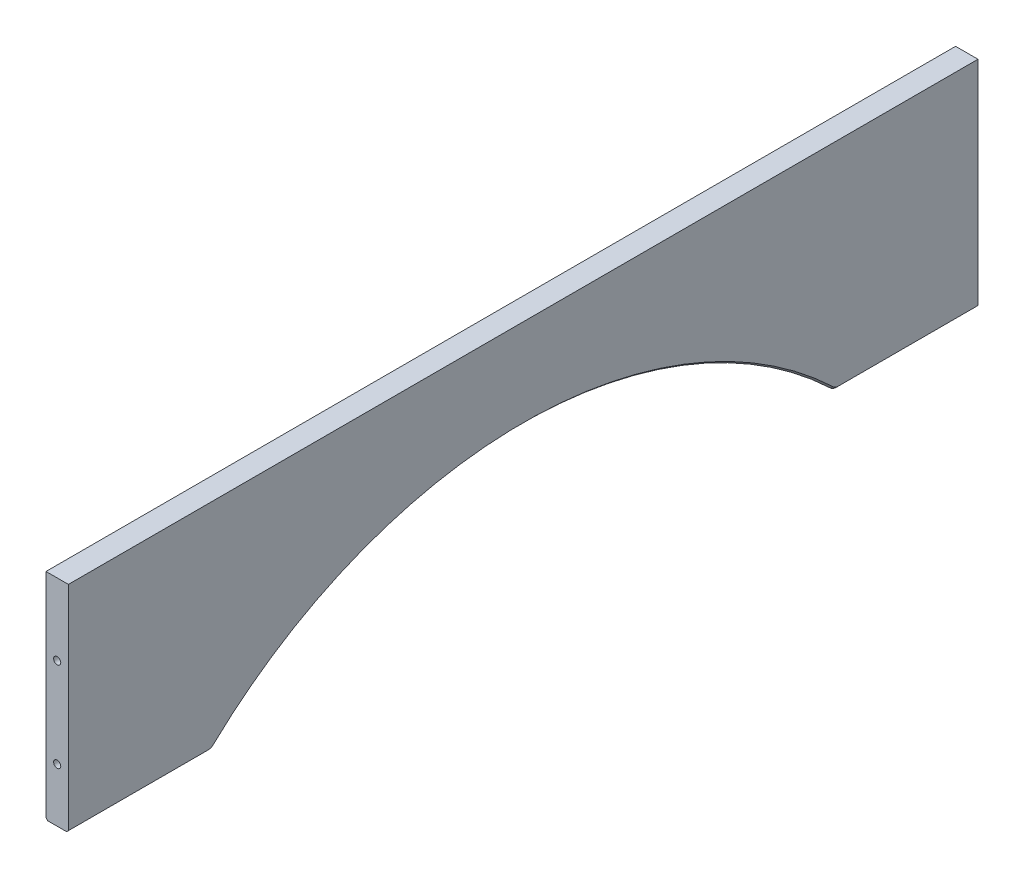
ISO-10303-21;
HEADER;
FILE_DESCRIPTION(('STEP AP214'),'2;1');
FILE_NAME('part.step','',(''),(''),'','','');
FILE_SCHEMA(('AUTOMOTIVE_DESIGN { 1 0 10303 214 1 1 1 1 }'));
ENDSEC;
DATA;
#1=APPLICATION_CONTEXT('core data for automotive mechanical design processes');
#2=APPLICATION_PROTOCOL_DEFINITION('international standard','automotive_design',2000,#1);
#3=PRODUCT_CONTEXT('',#1,'mechanical');
#4=PRODUCT('Part','Part','',(#3));
#5=PRODUCT_RELATED_PRODUCT_CATEGORY('part','',(#4));
#6=PRODUCT_DEFINITION_FORMATION('','',#4);
#7=PRODUCT_DEFINITION_CONTEXT('part definition',#1,'design');
#8=PRODUCT_DEFINITION('design','',#6,#7);
#9=PRODUCT_DEFINITION_SHAPE('','',#8);
#10=(LENGTH_UNIT() NAMED_UNIT(*) SI_UNIT(.MILLI.,.METRE.));
#11=(NAMED_UNIT(*) PLANE_ANGLE_UNIT() SI_UNIT($,.RADIAN.));
#12=(NAMED_UNIT(*) SI_UNIT($,.STERADIAN.) SOLID_ANGLE_UNIT());
#13=UNCERTAINTY_MEASURE_WITH_UNIT(LENGTH_MEASURE(1.E-05),#10,'distance_accuracy_value','');
#14=(GEOMETRIC_REPRESENTATION_CONTEXT(3) GLOBAL_UNCERTAINTY_ASSIGNED_CONTEXT((#13)) GLOBAL_UNIT_ASSIGNED_CONTEXT((#10,
#11,#12)) REPRESENTATION_CONTEXT('',''));
#15=CARTESIAN_POINT('',(0.,0.,0.));
#16=DIRECTION('',(0.,0.,1.));
#17=DIRECTION('',(1.,0.,0.));
#18=AXIS2_PLACEMENT_3D('',#15,#16,#17);
#19=CARTESIAN_POINT('',(212.725,-320.675,644.525));
#20=DIRECTION('',(0.,1.,0.));
#21=DIRECTION('',(0.,0.,1.));
#22=AXIS2_PLACEMENT_3D('',#19,#20,#21);
#23=PLANE('',#22);
#24=DIRECTION('',(-1.,0.,0.));
#25=VECTOR('',#24,1.);
#26=CARTESIAN_POINT('',(212.725,-320.675,-446.430115021653));
#27=LINE('',#26,#25);
#28=CARTESIAN_POINT('',(241.935,-320.675,-446.430115021653));
#29=VERTEX_POINT('',#28);
#30=CARTESIAN_POINT('',(215.265,-320.675,-446.430115021653));
#31=VERTEX_POINT('',#30);
#32=EDGE_CURVE('E181',#29,#31,#27,.T.);
#33=ORIENTED_EDGE('',*,*,#32,.T.);
#34=DIRECTION('',(0.,0.,-1.));
#35=VECTOR('',#34,1.);
#36=CARTESIAN_POINT('',(215.265,-320.675,644.525));
#37=LINE('',#36,#35);
#38=CARTESIAN_POINT('',(215.265,-320.675,-644.525));
#39=VERTEX_POINT('',#38);
#40=EDGE_CURVE('E186',#31,#39,#37,.T.);
#41=ORIENTED_EDGE('',*,*,#40,.T.);
#42=DIRECTION('',(1.,0.,0.));
#43=VECTOR('',#42,1.);
#44=CARTESIAN_POINT('',(212.725,-320.675,-644.525));
#45=LINE('',#44,#43);
#46=CARTESIAN_POINT('',(241.935,-320.675,-644.525));
#47=VERTEX_POINT('',#46);
#48=EDGE_CURVE('E144',#39,#47,#45,.T.);
#49=ORIENTED_EDGE('',*,*,#48,.T.);
#50=DIRECTION('',(0.,0.,1.));
#51=VECTOR('',#50,1.);
#52=CARTESIAN_POINT('',(241.935,-320.675,644.525));
#53=LINE('',#52,#51);
#54=EDGE_CURVE('E184',#47,#29,#53,.T.);
#55=ORIENTED_EDGE('',*,*,#54,.T.);
#56=EDGE_LOOP('',(#33,#41,#49,#55));
#57=FACE_BOUND('',#56,.T.);
#58=ADVANCED_FACE('F32',(#57),#23,.F.);
#59=DIRECTION('',(1.,0.,0.));
#60=VECTOR('',#59,1.);
#61=CARTESIAN_POINT('',(212.725,-320.675,644.525));
#62=LINE('',#61,#60);
#63=CARTESIAN_POINT('',(215.265,-320.675,644.525));
#64=VERTEX_POINT('',#63);
#65=CARTESIAN_POINT('',(241.935,-320.675,644.525));
#66=VERTEX_POINT('',#65);
#67=EDGE_CURVE('E160',#64,#66,#62,.T.);
#68=ORIENTED_EDGE('',*,*,#67,.F.);
#69=DIRECTION('',(0.,0.,-1.));
#70=VECTOR('',#69,1.);
#71=CARTESIAN_POINT('',(215.265,-320.675,644.525));
#72=LINE('',#71,#70);
#73=CARTESIAN_POINT('',(215.265,-320.675,446.430115021653));
#74=VERTEX_POINT('',#73);
#75=EDGE_CURVE('E205',#64,#74,#72,.T.);
#76=ORIENTED_EDGE('',*,*,#75,.T.);
#77=DIRECTION('',(-1.,0.,0.));
#78=VECTOR('',#77,1.);
#79=CARTESIAN_POINT('',(212.725,-320.675,446.430115021653));
#80=LINE('',#79,#78);
#81=CARTESIAN_POINT('',(241.935,-320.675,446.430115021653));
#82=VERTEX_POINT('',#81);
#83=EDGE_CURVE('E178',#74,#82,#80,.F.);
#84=ORIENTED_EDGE('',*,*,#83,.T.);
#85=DIRECTION('',(0.,0.,1.));
#86=VECTOR('',#85,1.);
#87=CARTESIAN_POINT('',(241.935,-320.675,644.525));
#88=LINE('',#87,#86);
#89=EDGE_CURVE('E203',#82,#66,#88,.T.);
#90=ORIENTED_EDGE('',*,*,#89,.T.);
#91=EDGE_LOOP('',(#68,#76,#84,#90));
#92=FACE_BOUND('',#91,.T.);
#93=ADVANCED_FACE('F34',(#92),#23,.F.);
#94=CARTESIAN_POINT('',(244.475,-320.675,644.525));
#95=DIRECTION('',(-1.,0.,0.));
#96=DIRECTION('',(0.,0.,1.));
#97=AXIS2_PLACEMENT_3D('',#94,#95,#96);
#98=PLANE('',#97);
#99=DIRECTION('',(0.,1.,0.));
#100=VECTOR('',#99,1.);
#101=CARTESIAN_POINT('',(244.475,-320.675,644.525));
#102=LINE('',#101,#100);
#103=CARTESIAN_POINT('',(244.475,-318.135,644.525));
#104=VERTEX_POINT('',#103);
#105=CARTESIAN_POINT('',(244.475,-15.875,644.525));
#106=VERTEX_POINT('',#105);
#107=EDGE_CURVE('E166',#104,#106,#102,.T.);
#108=ORIENTED_EDGE('',*,*,#107,.F.);
#109=DIRECTION('',(0.,0.,-1.));
#110=VECTOR('',#109,1.);
#111=CARTESIAN_POINT('',(244.475,-318.135,644.525));
#112=LINE('',#111,#110);
#113=CARTESIAN_POINT('',(244.475,-318.135,446.430115021653));
#114=VERTEX_POINT('',#113);
#115=EDGE_CURVE('E11',#104,#114,#112,.T.);
#116=ORIENTED_EDGE('',*,*,#115,.T.);
#117=CARTESIAN_POINT('',(244.475,-307.975,446.430115021653));
#118=DIRECTION('',(-1.,0.,0.));
#119=DIRECTION('',(0.,0.,1.));
#120=AXIS2_PLACEMENT_3D('',#117,#118,#119);
#121=CIRCLE('',#120,10.16);
#122=CARTESIAN_POINT('',(244.475,-315.336116582833,439.427289687981));
#123=VERTEX_POINT('',#122);
#124=EDGE_CURVE('E226',#114,#123,#121,.F.);
#125=ORIENTED_EDGE('',*,*,#124,.T.);
#126=CARTESIAN_POINT('',(244.475,-777.246182155642,0.));
#127=DIRECTION('',(-1.,0.,0.));
#128=DIRECTION('',(0.,0.,1.));
#129=AXIS2_PLACEMENT_3D('',#126,#127,#128);
#130=CIRCLE('',#129,637.54);
#131=CARTESIAN_POINT('',(244.475,-315.336116582833,-439.427289687981));
#132=VERTEX_POINT('',#131);
#133=EDGE_CURVE('E223',#123,#132,#130,.T.);
#134=ORIENTED_EDGE('',*,*,#133,.T.);
#135=CARTESIAN_POINT('',(244.475,-307.975,-446.430115021653));
#136=DIRECTION('',(-1.,0.,0.));
#137=DIRECTION('',(0.,0.,1.));
#138=AXIS2_PLACEMENT_3D('',#135,#136,#137);
#139=CIRCLE('',#138,10.1599999999999);
#140=CARTESIAN_POINT('',(244.475,-318.135,-446.430115021653));
#141=VERTEX_POINT('',#140);
#142=EDGE_CURVE('E55',#132,#141,#139,.F.);
#143=ORIENTED_EDGE('',*,*,#142,.T.);
#144=DIRECTION('',(0.,0.,-1.));
#145=VECTOR('',#144,1.);
#146=CARTESIAN_POINT('',(244.475,-318.135,644.525));
#147=LINE('',#146,#145);
#148=CARTESIAN_POINT('',(244.475,-318.135,-644.525));
#149=VERTEX_POINT('',#148);
#150=EDGE_CURVE('E40',#141,#149,#147,.T.);
#151=ORIENTED_EDGE('',*,*,#150,.T.);
#152=DIRECTION('',(0.,1.,0.));
#153=VECTOR('',#152,1.);
#154=CARTESIAN_POINT('',(244.475,-320.675,-644.525));
#155=LINE('',#154,#153);
#156=CARTESIAN_POINT('',(244.475,-15.875,-644.525));
#157=VERTEX_POINT('',#156);
#158=EDGE_CURVE('E134',#149,#157,#155,.T.);
#159=ORIENTED_EDGE('',*,*,#158,.T.);
#160=DIRECTION('',(0.,0.,-1.));
#161=VECTOR('',#160,1.);
#162=CARTESIAN_POINT('',(244.475,-15.875,644.525));
#163=LINE('',#162,#161);
#164=EDGE_CURVE('E138',#106,#157,#163,.T.);
#165=ORIENTED_EDGE('',*,*,#164,.F.);
#166=EDGE_LOOP('',(#108,#116,#125,#134,#143,#151,#159,#165));
#167=FACE_BOUND('',#166,.T.);
#168=ADVANCED_FACE('F137',(#167),#98,.F.);
#169=CARTESIAN_POINT('',(244.475,-15.875,644.525));
#170=DIRECTION('',(0.,-1.,0.));
#171=DIRECTION('',(0.,0.,-1.));
#172=AXIS2_PLACEMENT_3D('',#169,#170,#171);
#173=PLANE('',#172);
#174=DIRECTION('',(-1.,0.,0.));
#175=VECTOR('',#174,1.);
#176=CARTESIAN_POINT('',(244.475,-15.875,-644.525));
#177=LINE('',#176,#175);
#178=CARTESIAN_POINT('',(212.725,-15.875,-644.525));
#179=VERTEX_POINT('',#178);
#180=EDGE_CURVE('E143',#157,#179,#177,.T.);
#181=ORIENTED_EDGE('',*,*,#180,.T.);
#182=DIRECTION('',(0.,0.,-1.));
#183=VECTOR('',#182,1.);
#184=CARTESIAN_POINT('',(212.725,-15.875,644.525));
#185=LINE('',#184,#183);
#186=CARTESIAN_POINT('',(212.725,-15.875,644.525));
#187=VERTEX_POINT('',#186);
#188=EDGE_CURVE('E152',#187,#179,#185,.T.);
#189=ORIENTED_EDGE('',*,*,#188,.F.);
#190=DIRECTION('',(-1.,0.,0.));
#191=VECTOR('',#190,1.);
#192=CARTESIAN_POINT('',(244.475,-15.875,644.525));
#193=LINE('',#192,#191);
#194=EDGE_CURVE('E150',#106,#187,#193,.T.);
#195=ORIENTED_EDGE('',*,*,#194,.F.);
#196=ORIENTED_EDGE('',*,*,#164,.T.);
#197=EDGE_LOOP('',(#181,#189,#195,#196));
#198=FACE_BOUND('',#197,.T.);
#199=ADVANCED_FACE('F147',(#198),#173,.F.);
#200=CARTESIAN_POINT('',(212.725,-320.675,644.525));
#201=DIRECTION('',(1.,0.,0.));
#202=DIRECTION('',(0.,0.,-1.));
#203=AXIS2_PLACEMENT_3D('',#200,#201,#202);
#204=PLANE('',#203);
#205=DIRECTION('',(0.,-1.,0.));
#206=VECTOR('',#205,1.);
#207=CARTESIAN_POINT('',(212.725,-320.675,-644.525));
#208=LINE('',#207,#206);
#209=CARTESIAN_POINT('',(212.725,-318.135,-644.525));
#210=VERTEX_POINT('',#209);
#211=EDGE_CURVE('E158',#179,#210,#208,.T.);
#212=ORIENTED_EDGE('',*,*,#211,.T.);
#213=DIRECTION('',(0.,0.,1.));
#214=VECTOR('',#213,1.);
#215=CARTESIAN_POINT('',(212.725,-318.135,644.525));
#216=LINE('',#215,#214);
#217=CARTESIAN_POINT('',(212.725,-318.135,-446.430115021653));
#218=VERTEX_POINT('',#217);
#219=EDGE_CURVE('E201',#210,#218,#216,.T.);
#220=ORIENTED_EDGE('',*,*,#219,.T.);
#221=CARTESIAN_POINT('',(212.725,-307.975,-446.430115021653));
#222=DIRECTION('',(1.,0.,0.));
#223=DIRECTION('',(0.,0.,-1.));
#224=AXIS2_PLACEMENT_3D('',#221,#222,#223);
#225=CIRCLE('',#224,10.1599999999998);
#226=CARTESIAN_POINT('',(212.725,-315.336116582833,-439.427289687981));
#227=VERTEX_POINT('',#226);
#228=EDGE_CURVE('E197',#218,#227,#225,.F.);
#229=ORIENTED_EDGE('',*,*,#228,.T.);
#230=CARTESIAN_POINT('',(212.725,-777.246182155642,0.));
#231=DIRECTION('',(1.,0.,0.));
#232=DIRECTION('',(0.,0.,-1.));
#233=AXIS2_PLACEMENT_3D('',#230,#231,#232);
#234=CIRCLE('',#233,637.54);
#235=CARTESIAN_POINT('',(212.725,-315.336116582833,439.427289687981));
#236=VERTEX_POINT('',#235);
#237=EDGE_CURVE('E193',#227,#236,#234,.T.);
#238=ORIENTED_EDGE('',*,*,#237,.T.);
#239=CARTESIAN_POINT('',(212.725,-307.975,446.430115021653));
#240=DIRECTION('',(1.,0.,0.));
#241=DIRECTION('',(0.,0.,-1.));
#242=AXIS2_PLACEMENT_3D('',#239,#240,#241);
#243=CIRCLE('',#242,10.1599999999997);
#244=CARTESIAN_POINT('',(212.725,-318.135,446.430115021653));
#245=VERTEX_POINT('',#244);
#246=EDGE_CURVE('E195',#236,#245,#243,.F.);
#247=ORIENTED_EDGE('',*,*,#246,.T.);
#248=DIRECTION('',(0.,0.,1.));
#249=VECTOR('',#248,1.);
#250=CARTESIAN_POINT('',(212.725,-318.135,644.525));
#251=LINE('',#250,#249);
#252=CARTESIAN_POINT('',(212.725,-318.135,644.525));
#253=VERTEX_POINT('',#252);
#254=EDGE_CURVE('E199',#245,#253,#251,.T.);
#255=ORIENTED_EDGE('',*,*,#254,.T.);
#256=DIRECTION('',(0.,-1.,0.));
#257=VECTOR('',#256,1.);
#258=CARTESIAN_POINT('',(212.725,-320.675,644.525));
#259=LINE('',#258,#257);
#260=EDGE_CURVE('E169',#187,#253,#259,.T.);
#261=ORIENTED_EDGE('',*,*,#260,.F.);
#262=ORIENTED_EDGE('',*,*,#188,.T.);
#263=EDGE_LOOP('',(#212,#220,#229,#238,#247,#255,#261,#262));
#264=FACE_BOUND('',#263,.T.);
#265=ADVANCED_FACE('F314',(#264),#204,.F.);
#266=CARTESIAN_POINT('',(244.475,-320.675,644.525));
#267=DIRECTION('',(0.,0.,1.));
#268=DIRECTION('',(1.,0.,0.));
#269=AXIS2_PLACEMENT_3D('',#266,#267,#268);
#270=PLANE('',#269);
#271=CARTESIAN_POINT('',(228.6,-244.475,644.525));
#272=DIRECTION('',(0.,0.,-1.));
#273=DIRECTION('',(-1.,0.,0.));
#274=AXIS2_PLACEMENT_3D('',#271,#272,#273);
#275=CIRCLE('',#274,5.04189999999998);
#276=CARTESIAN_POINT('',(223.5581,-244.475,644.525));
#277=VERTEX_POINT('',#276);
#278=EDGE_CURVE('E259',#277,#277,#275,.T.);
#279=ORIENTED_EDGE('',*,*,#278,.T.);
#280=EDGE_LOOP('',(#279));
#281=FACE_BOUND('',#280,.T.);
#282=CARTESIAN_POINT('',(228.6,-117.475,644.525));
#283=DIRECTION('',(0.,0.,-1.));
#284=DIRECTION('',(-1.,0.,0.));
#285=AXIS2_PLACEMENT_3D('',#282,#283,#284);
#286=CIRCLE('',#285,5.04189999999998);
#287=CARTESIAN_POINT('',(223.5581,-117.475,644.525));
#288=VERTEX_POINT('',#287);
#289=EDGE_CURVE('E265',#288,#288,#286,.T.);
#290=ORIENTED_EDGE('',*,*,#289,.T.);
#291=EDGE_LOOP('',(#290));
#292=FACE_BOUND('',#291,.T.);
#293=ORIENTED_EDGE('',*,*,#260,.T.);
#294=DIRECTION('',(-0.707106781186536,0.707106781186559,0.));
#295=VECTOR('',#294,1.);
#296=CARTESIAN_POINT('',(229.87,-335.28,644.525));
#297=LINE('',#296,#295);
#298=EDGE_CURVE('E209',#253,#64,#297,.F.);
#299=ORIENTED_EDGE('',*,*,#298,.T.);
#300=ORIENTED_EDGE('',*,*,#67,.T.);
#301=DIRECTION('',(-0.707106781186532,-0.707106781186563,0.));
#302=VECTOR('',#301,1.);
#303=CARTESIAN_POINT('',(243.205,-319.405,644.525));
#304=LINE('',#303,#302);
#305=EDGE_CURVE('E207',#66,#104,#304,.F.);
#306=ORIENTED_EDGE('',*,*,#305,.T.);
#307=ORIENTED_EDGE('',*,*,#107,.T.);
#308=ORIENTED_EDGE('',*,*,#194,.T.);
#309=EDGE_LOOP('',(#293,#299,#300,#306,#307,#308));
#310=FACE_BOUND('',#309,.T.);
#311=ADVANCED_FACE('F319',(#281,#292,#310),#270,.T.);
#312=CARTESIAN_POINT('',(244.475,-320.675,-644.525));
#313=DIRECTION('',(0.,0.,1.));
#314=DIRECTION('',(1.,0.,0.));
#315=AXIS2_PLACEMENT_3D('',#312,#313,#314);
#316=PLANE('',#315);
#317=CARTESIAN_POINT('',(228.6,-117.475,-644.525));
#318=DIRECTION('',(0.,0.,-1.));
#319=DIRECTION('',(-1.,0.,0.));
#320=AXIS2_PLACEMENT_3D('',#317,#318,#319);
#321=CIRCLE('',#320,5.04189999999998);
#322=CARTESIAN_POINT('',(223.5581,-117.475,-644.525));
#323=VERTEX_POINT('',#322);
#324=EDGE_CURVE('E271',#323,#323,#321,.T.);
#325=ORIENTED_EDGE('',*,*,#324,.F.);
#326=EDGE_LOOP('',(#325));
#327=FACE_BOUND('',#326,.T.);
#328=CARTESIAN_POINT('',(228.6,-244.475,-644.525));
#329=DIRECTION('',(0.,0.,-1.));
#330=DIRECTION('',(-1.,0.,0.));
#331=AXIS2_PLACEMENT_3D('',#328,#329,#330);
#332=CIRCLE('',#331,5.04189999999998);
#333=CARTESIAN_POINT('',(223.5581,-244.475,-644.525));
#334=VERTEX_POINT('',#333);
#335=EDGE_CURVE('E277',#334,#334,#332,.T.);
#336=ORIENTED_EDGE('',*,*,#335,.F.);
#337=EDGE_LOOP('',(#336));
#338=FACE_BOUND('',#337,.T.);
#339=ORIENTED_EDGE('',*,*,#48,.F.);
#340=DIRECTION('',(0.707106781186536,-0.707106781186559,0.));
#341=VECTOR('',#340,1.);
#342=CARTESIAN_POINT('',(215.265,-320.675,-644.525));
#343=LINE('',#342,#341);
#344=EDGE_CURVE('E191',#39,#210,#343,.F.);
#345=ORIENTED_EDGE('',*,*,#344,.T.);
#346=ORIENTED_EDGE('',*,*,#211,.F.);
#347=ORIENTED_EDGE('',*,*,#180,.F.);
#348=ORIENTED_EDGE('',*,*,#158,.F.);
#349=DIRECTION('',(0.707106781186532,0.707106781186563,0.));
#350=VECTOR('',#349,1.);
#351=CARTESIAN_POINT('',(244.475,-318.135,-644.525));
#352=LINE('',#351,#350);
#353=EDGE_CURVE('E189',#149,#47,#352,.F.);
#354=ORIENTED_EDGE('',*,*,#353,.T.);
#355=EDGE_LOOP('',(#339,#345,#346,#347,#348,#354));
#356=FACE_BOUND('',#355,.T.);
#357=ADVANCED_FACE('F156',(#327,#338,#356),#316,.F.);
#358=CARTESIAN_POINT('',(228.6,-244.475,-619.125));
#359=DIRECTION('',(0.,0.,-1.));
#360=DIRECTION('',(-1.,0.,0.));
#361=AXIS2_PLACEMENT_3D('',#358,#359,#360);
#362=CYLINDRICAL_SURFACE('',#361,5.04189999999998);
#363=CARTESIAN_POINT('',(228.6,-244.475,-619.125));
#364=DIRECTION('',(0.,0.,-1.));
#365=DIRECTION('',(-1.,0.,0.));
#366=AXIS2_PLACEMENT_3D('',#363,#364,#365);
#367=CIRCLE('',#366,5.04189999999998);
#368=CARTESIAN_POINT('',(223.5581,-244.475,-619.125));
#369=VERTEX_POINT('',#368);
#370=EDGE_CURVE('E280',#369,#369,#367,.T.);
#371=ORIENTED_EDGE('',*,*,#370,.F.);
#372=EDGE_LOOP('',(#371));
#373=FACE_BOUND('',#372,.T.);
#374=ORIENTED_EDGE('',*,*,#335,.T.);
#375=EDGE_LOOP('',(#374));
#376=FACE_BOUND('',#375,.T.);
#377=ADVANCED_FACE('F360',(#373,#376),#362,.F.);
#378=CARTESIAN_POINT('',(228.6,-244.475,-619.125));
#379=DIRECTION('',(0.,0.,-1.));
#380=DIRECTION('',(-1.,0.,0.));
#381=AXIS2_PLACEMENT_3D('',#378,#379,#380);
#382=PLANE('',#381);
#383=ORIENTED_EDGE('',*,*,#370,.T.);
#384=EDGE_LOOP('',(#383));
#385=FACE_BOUND('',#384,.T.);
#386=ADVANCED_FACE('F364',(#385),#382,.T.);
#387=CARTESIAN_POINT('',(228.6,-117.475,-619.125));
#388=DIRECTION('',(0.,0.,-1.));
#389=DIRECTION('',(-1.,0.,0.));
#390=AXIS2_PLACEMENT_3D('',#387,#388,#389);
#391=CYLINDRICAL_SURFACE('',#390,5.04189999999998);
#392=CARTESIAN_POINT('',(228.6,-117.475,-619.125));
#393=DIRECTION('',(0.,0.,-1.));
#394=DIRECTION('',(-1.,0.,0.));
#395=AXIS2_PLACEMENT_3D('',#392,#393,#394);
#396=CIRCLE('',#395,5.04189999999998);
#397=CARTESIAN_POINT('',(223.5581,-117.475,-619.125));
#398=VERTEX_POINT('',#397);
#399=EDGE_CURVE('E274',#398,#398,#396,.T.);
#400=ORIENTED_EDGE('',*,*,#399,.F.);
#401=EDGE_LOOP('',(#400));
#402=FACE_BOUND('',#401,.T.);
#403=ORIENTED_EDGE('',*,*,#324,.T.);
#404=EDGE_LOOP('',(#403));
#405=FACE_BOUND('',#404,.T.);
#406=ADVANCED_FACE('F368',(#402,#405),#391,.F.);
#407=CARTESIAN_POINT('',(228.6,-117.475,-619.125));
#408=DIRECTION('',(0.,0.,-1.));
#409=DIRECTION('',(-1.,0.,0.));
#410=AXIS2_PLACEMENT_3D('',#407,#408,#409);
#411=PLANE('',#410);
#412=ORIENTED_EDGE('',*,*,#399,.T.);
#413=EDGE_LOOP('',(#412));
#414=FACE_BOUND('',#413,.T.);
#415=ADVANCED_FACE('F372',(#414),#411,.T.);
#416=CARTESIAN_POINT('',(228.6,-117.475,619.125));
#417=DIRECTION('',(0.,0.,1.));
#418=DIRECTION('',(-1.,0.,0.));
#419=AXIS2_PLACEMENT_3D('',#416,#417,#418);
#420=CYLINDRICAL_SURFACE('',#419,5.04189999999998);
#421=CARTESIAN_POINT('',(228.6,-117.475,619.125));
#422=DIRECTION('',(0.,0.,-1.));
#423=DIRECTION('',(-1.,0.,0.));
#424=AXIS2_PLACEMENT_3D('',#421,#422,#423);
#425=CIRCLE('',#424,5.04189999999998);
#426=CARTESIAN_POINT('',(223.5581,-117.475,619.125));
#427=VERTEX_POINT('',#426);
#428=EDGE_CURVE('E268',#427,#427,#425,.T.);
#429=ORIENTED_EDGE('',*,*,#428,.T.);
#430=EDGE_LOOP('',(#429));
#431=FACE_BOUND('',#430,.T.);
#432=ORIENTED_EDGE('',*,*,#289,.F.);
#433=EDGE_LOOP('',(#432));
#434=FACE_BOUND('',#433,.T.);
#435=ADVANCED_FACE('F376',(#431,#434),#420,.F.);
#436=CARTESIAN_POINT('',(228.6,-117.475,619.125));
#437=DIRECTION('',(0.,0.,1.));
#438=DIRECTION('',(-1.,0.,0.));
#439=AXIS2_PLACEMENT_3D('',#436,#437,#438);
#440=PLANE('',#439);
#441=ORIENTED_EDGE('',*,*,#428,.F.);
#442=EDGE_LOOP('',(#441));
#443=FACE_BOUND('',#442,.T.);
#444=ADVANCED_FACE('F380',(#443),#440,.T.);
#445=CARTESIAN_POINT('',(228.6,-244.475,619.125));
#446=DIRECTION('',(0.,0.,1.));
#447=DIRECTION('',(-1.,0.,0.));
#448=AXIS2_PLACEMENT_3D('',#445,#446,#447);
#449=CYLINDRICAL_SURFACE('',#448,5.04189999999998);
#450=CARTESIAN_POINT('',(228.6,-244.475,619.125));
#451=DIRECTION('',(0.,0.,-1.));
#452=DIRECTION('',(-1.,0.,0.));
#453=AXIS2_PLACEMENT_3D('',#450,#451,#452);
#454=CIRCLE('',#453,5.04189999999998);
#455=CARTESIAN_POINT('',(223.5581,-244.475,619.125));
#456=VERTEX_POINT('',#455);
#457=EDGE_CURVE('E262',#456,#456,#454,.T.);
#458=ORIENTED_EDGE('',*,*,#457,.T.);
#459=EDGE_LOOP('',(#458));
#460=FACE_BOUND('',#459,.T.);
#461=ORIENTED_EDGE('',*,*,#278,.F.);
#462=EDGE_LOOP('',(#461));
#463=FACE_BOUND('',#462,.T.);
#464=ADVANCED_FACE('F384',(#460,#463),#449,.F.);
#465=CARTESIAN_POINT('',(228.6,-244.475,619.125));
#466=DIRECTION('',(0.,0.,1.));
#467=DIRECTION('',(-1.,0.,0.));
#468=AXIS2_PLACEMENT_3D('',#465,#466,#467);
#469=PLANE('',#468);
#470=ORIENTED_EDGE('',*,*,#457,.F.);
#471=EDGE_LOOP('',(#470));
#472=FACE_BOUND('',#471,.T.);
#473=ADVANCED_FACE('F388',(#472),#469,.T.);
#474=CARTESIAN_POINT('',(1900.69481340416,-777.246182155642,0.));
#475=DIRECTION('',(-1.,0.,0.));
#476=DIRECTION('',(0.,-1.,0.));
#477=AXIS2_PLACEMENT_3D('',#474,#475,#476);
#478=CYLINDRICAL_SURFACE('',#477,635.);
#479=DIRECTION('',(-1.,0.,0.));
#480=VECTOR('',#479,1.);
#481=CARTESIAN_POINT('',(1900.69481340416,-317.176395728542,437.676583354562));
#482=LINE('',#481,#480);
#483=CARTESIAN_POINT('',(241.935,-317.176395728542,437.676583354562));
#484=VERTEX_POINT('',#483);
#485=CARTESIAN_POINT('',(215.265,-317.176395728542,437.676583354562));
#486=VERTEX_POINT('',#485);
#487=EDGE_CURVE('E175',#484,#486,#482,.T.);
#488=ORIENTED_EDGE('',*,*,#487,.T.);
#489=CARTESIAN_POINT('',(215.265,-777.246182155642,0.));
#490=DIRECTION('',(1.,0.,0.));
#491=DIRECTION('',(0.,0.,-1.));
#492=AXIS2_PLACEMENT_3D('',#489,#490,#491);
#493=CIRCLE('',#492,635.);
#494=CARTESIAN_POINT('',(215.265,-317.176395728542,-437.676583354562));
#495=VERTEX_POINT('',#494);
#496=EDGE_CURVE('E221',#486,#495,#493,.F.);
#497=ORIENTED_EDGE('',*,*,#496,.T.);
#498=DIRECTION('',(-1.,0.,0.));
#499=VECTOR('',#498,1.);
#500=CARTESIAN_POINT('',(1900.69481340416,-317.176395728542,-437.676583354562));
#501=LINE('',#500,#499);
#502=CARTESIAN_POINT('',(241.935,-317.176395728542,-437.676583354562));
#503=VERTEX_POINT('',#502);
#504=EDGE_CURVE('E151',#495,#503,#501,.F.);
#505=ORIENTED_EDGE('',*,*,#504,.T.);
#506=CARTESIAN_POINT('',(241.935,-777.246182155642,0.));
#507=DIRECTION('',(-1.,0.,0.));
#508=DIRECTION('',(0.,0.,1.));
#509=AXIS2_PLACEMENT_3D('',#506,#507,#508);
#510=CIRCLE('',#509,635.);
#511=EDGE_CURVE('E219',#503,#484,#510,.F.);
#512=ORIENTED_EDGE('',*,*,#511,.T.);
#513=EDGE_LOOP('',(#488,#497,#505,#512));
#514=FACE_BOUND('',#513,.T.);
#515=ADVANCED_FACE('F298',(#514),#478,.F.);
#516=CARTESIAN_POINT('',(1900.69481340416,-307.975,446.430115021653));
#517=DIRECTION('',(-1.,0.,0.));
#518=DIRECTION('',(0.,-1.,0.));
#519=AXIS2_PLACEMENT_3D('',#516,#517,#518);
#520=CYLINDRICAL_SURFACE('',#519,12.7);
#521=ORIENTED_EDGE('',*,*,#83,.F.);
#522=CARTESIAN_POINT('',(215.265,-307.975,446.430115021653));
#523=DIRECTION('',(1.,0.,0.));
#524=DIRECTION('',(0.,0.,-1.));
#525=AXIS2_PLACEMENT_3D('',#522,#523,#524);
#526=CIRCLE('',#525,12.7);
#527=EDGE_CURVE('E217',#74,#486,#526,.T.);
#528=ORIENTED_EDGE('',*,*,#527,.T.);
#529=ORIENTED_EDGE('',*,*,#487,.F.);
#530=CARTESIAN_POINT('',(241.935,-307.975,446.430115021653));
#531=DIRECTION('',(-1.,0.,0.));
#532=DIRECTION('',(0.,0.,1.));
#533=AXIS2_PLACEMENT_3D('',#530,#531,#532);
#534=CIRCLE('',#533,12.7);
#535=EDGE_CURVE('E215',#484,#82,#534,.T.);
#536=ORIENTED_EDGE('',*,*,#535,.T.);
#537=EDGE_LOOP('',(#521,#528,#529,#536));
#538=FACE_BOUND('',#537,.T.);
#539=ADVANCED_FACE('F329',(#538),#520,.T.);
#540=CARTESIAN_POINT('',(1900.69481340416,-307.975,-446.430115021653));
#541=DIRECTION('',(-1.,0.,0.));
#542=DIRECTION('',(0.,-1.,0.));
#543=AXIS2_PLACEMENT_3D('',#540,#541,#542);
#544=CYLINDRICAL_SURFACE('',#543,12.7);
#545=ORIENTED_EDGE('',*,*,#504,.F.);
#546=CARTESIAN_POINT('',(215.265,-307.975,-446.430115021653));
#547=DIRECTION('',(1.,0.,0.));
#548=DIRECTION('',(0.,0.,-1.));
#549=AXIS2_PLACEMENT_3D('',#546,#547,#548);
#550=CIRCLE('',#549,12.7);
#551=EDGE_CURVE('E213',#495,#31,#550,.T.);
#552=ORIENTED_EDGE('',*,*,#551,.T.);
#553=ORIENTED_EDGE('',*,*,#32,.F.);
#554=CARTESIAN_POINT('',(241.935,-307.975,-446.430115021653));
#555=DIRECTION('',(-1.,0.,0.));
#556=DIRECTION('',(0.,0.,1.));
#557=AXIS2_PLACEMENT_3D('',#554,#555,#556);
#558=CIRCLE('',#557,12.7);
#559=EDGE_CURVE('E211',#29,#503,#558,.T.);
#560=ORIENTED_EDGE('',*,*,#559,.T.);
#561=EDGE_LOOP('',(#545,#552,#553,#560));
#562=FACE_BOUND('',#561,.T.);
#563=ADVANCED_FACE('F295',(#562),#544,.T.);
#564=CARTESIAN_POINT('',(215.265,-320.675,644.525));
#565=DIRECTION('',(0.707106781186559,0.707106781186536,0.));
#566=DIRECTION('',(-0.707106781186536,0.707106781186559,0.));
#567=AXIS2_PLACEMENT_3D('',#564,#565,#566);
#568=PLANE('',#567);
#569=ORIENTED_EDGE('',*,*,#298,.F.);
#570=ORIENTED_EDGE('',*,*,#254,.F.);
#571=DIRECTION('',(-0.707106781186536,0.707106781186559,0.));
#572=VECTOR('',#571,1.);
#573=CARTESIAN_POINT('',(215.265,-320.675,446.430115021653));
#574=LINE('',#573,#572);
#575=EDGE_CURVE('E256',#74,#245,#574,.T.);
#576=ORIENTED_EDGE('',*,*,#575,.F.);
#577=ORIENTED_EDGE('',*,*,#75,.F.);
#578=EDGE_LOOP('',(#569,#570,#576,#577));
#579=FACE_BOUND('',#578,.T.);
#580=ADVANCED_FACE('F323',(#579),#568,.F.);
#581=CARTESIAN_POINT('',(212.725,-307.975,446.430115021653));
#582=DIRECTION('',(1.,0.,0.));
#583=DIRECTION('',(0.,0.,-1.));
#584=AXIS2_PLACEMENT_3D('',#581,#582,#583);
#585=CONICAL_SURFACE('',#584,10.1599999999998,0.785398163397494);
#586=ORIENTED_EDGE('',*,*,#575,.T.);
#587=ORIENTED_EDGE('',*,*,#246,.F.);
#588=DIRECTION('',(-0.707106781186508,0.512312544569554,0.487376504026121));
#589=VECTOR('',#588,1.);
#590=CARTESIAN_POINT('',(215.265,-317.176395728542,437.676583354562));
#591=LINE('',#590,#589);
#592=EDGE_CURVE('E253',#486,#236,#591,.T.);
#593=ORIENTED_EDGE('',*,*,#592,.F.);
#594=ORIENTED_EDGE('',*,*,#527,.F.);
#595=EDGE_LOOP('',(#586,#587,#593,#594));
#596=FACE_BOUND('',#595,.T.);
#597=ADVANCED_FACE('F331',(#596),#585,.T.);
#598=CARTESIAN_POINT('',(212.725,-777.246182155642,0.));
#599=DIRECTION('',(-1.,0.,0.));
#600=DIRECTION('',(0.,0.,1.));
#601=AXIS2_PLACEMENT_3D('',#598,#599,#600);
#602=CONICAL_SURFACE('',#601,637.54,0.785398163397492);
#603=ORIENTED_EDGE('',*,*,#592,.T.);
#604=ORIENTED_EDGE('',*,*,#237,.F.);
#605=DIRECTION('',(-0.707106781186508,0.512312544569554,-0.487376504026121));
#606=VECTOR('',#605,1.);
#607=CARTESIAN_POINT('',(215.265,-317.176395728542,-437.676583354562));
#608=LINE('',#607,#606);
#609=EDGE_CURVE('E250',#495,#227,#608,.T.);
#610=ORIENTED_EDGE('',*,*,#609,.F.);
#611=ORIENTED_EDGE('',*,*,#496,.F.);
#612=EDGE_LOOP('',(#603,#604,#610,#611));
#613=FACE_BOUND('',#612,.T.);
#614=ADVANCED_FACE('F303',(#613),#602,.F.);
#615=CARTESIAN_POINT('',(212.725,-307.975,-446.430115021653));
#616=DIRECTION('',(1.,0.,0.));
#617=DIRECTION('',(0.,0.,-1.));
#618=AXIS2_PLACEMENT_3D('',#615,#616,#617);
#619=CONICAL_SURFACE('',#618,10.1599999999998,0.78539816339749);
#620=ORIENTED_EDGE('',*,*,#609,.T.);
#621=ORIENTED_EDGE('',*,*,#228,.F.);
#622=DIRECTION('',(-0.70710678118652,0.707106781186575,0.));
#623=VECTOR('',#622,1.);
#624=CARTESIAN_POINT('',(215.265,-320.675,-446.430115021653));
#625=LINE('',#624,#623);
#626=EDGE_CURVE('E247',#31,#218,#625,.T.);
#627=ORIENTED_EDGE('',*,*,#626,.F.);
#628=ORIENTED_EDGE('',*,*,#551,.F.);
#629=EDGE_LOOP('',(#620,#621,#627,#628));
#630=FACE_BOUND('',#629,.T.);
#631=ADVANCED_FACE('F309',(#630),#619,.T.);
#632=CARTESIAN_POINT('',(215.265,-320.675,644.525));
#633=DIRECTION('',(0.707106781186559,0.707106781186536,0.));
#634=DIRECTION('',(-0.707106781186536,0.707106781186559,0.));
#635=AXIS2_PLACEMENT_3D('',#632,#633,#634);
#636=PLANE('',#635);
#637=ORIENTED_EDGE('',*,*,#626,.T.);
#638=ORIENTED_EDGE('',*,*,#219,.F.);
#639=ORIENTED_EDGE('',*,*,#344,.F.);
#640=ORIENTED_EDGE('',*,*,#40,.F.);
#641=EDGE_LOOP('',(#637,#638,#639,#640));
#642=FACE_BOUND('',#641,.T.);
#643=ADVANCED_FACE('F312',(#642),#636,.F.);
#644=CARTESIAN_POINT('',(244.475,-318.135,644.525));
#645=DIRECTION('',(-0.707106781186563,0.707106781186532,0.));
#646=DIRECTION('',(-0.707106781186532,-0.707106781186563,0.));
#647=AXIS2_PLACEMENT_3D('',#644,#645,#646);
#648=PLANE('',#647);
#649=ORIENTED_EDGE('',*,*,#353,.F.);
#650=ORIENTED_EDGE('',*,*,#150,.F.);
#651=DIRECTION('',(0.707106781186532,0.707106781186563,0.));
#652=VECTOR('',#651,1.);
#653=CARTESIAN_POINT('',(241.935,-320.675,-446.430115021653));
#654=LINE('',#653,#652);
#655=EDGE_CURVE('E241',#29,#141,#654,.T.);
#656=ORIENTED_EDGE('',*,*,#655,.F.);
#657=ORIENTED_EDGE('',*,*,#54,.F.);
#658=EDGE_LOOP('',(#649,#650,#656,#657));
#659=FACE_BOUND('',#658,.T.);
#660=ADVANCED_FACE('F289',(#659),#648,.F.);
#661=CARTESIAN_POINT('',(244.475,-307.975,-446.430115021653));
#662=DIRECTION('',(-1.,0.,0.));
#663=DIRECTION('',(0.,0.,1.));
#664=AXIS2_PLACEMENT_3D('',#661,#662,#663);
#665=CONICAL_SURFACE('',#664,10.1599999999998,0.785398163397439);
#666=ORIENTED_EDGE('',*,*,#655,.T.);
#667=ORIENTED_EDGE('',*,*,#142,.F.);
#668=DIRECTION('',(0.70710678118655,0.512312544569525,-0.487376504026092));
#669=VECTOR('',#668,1.);
#670=CARTESIAN_POINT('',(241.935,-317.176395728542,-437.676583354562));
#671=LINE('',#670,#669);
#672=EDGE_CURVE('E238',#503,#132,#671,.T.);
#673=ORIENTED_EDGE('',*,*,#672,.F.);
#674=ORIENTED_EDGE('',*,*,#559,.F.);
#675=EDGE_LOOP('',(#666,#667,#673,#674));
#676=FACE_BOUND('',#675,.T.);
#677=ADVANCED_FACE('F292',(#676),#665,.T.);
#678=CARTESIAN_POINT('',(244.475,-777.246182155642,0.));
#679=DIRECTION('',(1.,0.,0.));
#680=DIRECTION('',(0.,0.,-1.));
#681=AXIS2_PLACEMENT_3D('',#678,#679,#680);
#682=CONICAL_SURFACE('',#681,637.54,0.785398163397448);
#683=ORIENTED_EDGE('',*,*,#672,.T.);
#684=ORIENTED_EDGE('',*,*,#133,.F.);
#685=DIRECTION('',(0.707106781186539,0.512312544569532,0.4873765040261));
#686=VECTOR('',#685,1.);
#687=CARTESIAN_POINT('',(241.935,-317.176395728542,437.676583354562));
#688=LINE('',#687,#686);
#689=EDGE_CURVE('E235',#484,#123,#688,.T.);
#690=ORIENTED_EDGE('',*,*,#689,.F.);
#691=ORIENTED_EDGE('',*,*,#511,.F.);
#692=EDGE_LOOP('',(#683,#684,#690,#691));
#693=FACE_BOUND('',#692,.T.);
#694=ADVANCED_FACE('F233',(#693),#682,.F.);
#695=CARTESIAN_POINT('',(244.475,-307.975,446.430115021653));
#696=DIRECTION('',(-1.,0.,0.));
#697=DIRECTION('',(0.,0.,1.));
#698=AXIS2_PLACEMENT_3D('',#695,#696,#697);
#699=CONICAL_SURFACE('',#698,10.1599999999999,0.785398163397431);
#700=ORIENTED_EDGE('',*,*,#689,.T.);
#701=ORIENTED_EDGE('',*,*,#124,.F.);
#702=DIRECTION('',(0.707106781186563,0.707106781186532,0.));
#703=VECTOR('',#702,1.);
#704=CARTESIAN_POINT('',(241.935,-320.675,446.430115021653));
#705=LINE('',#704,#703);
#706=EDGE_CURVE('E47',#82,#114,#705,.T.);
#707=ORIENTED_EDGE('',*,*,#706,.F.);
#708=ORIENTED_EDGE('',*,*,#535,.F.);
#709=EDGE_LOOP('',(#700,#701,#707,#708));
#710=FACE_BOUND('',#709,.T.);
#711=ADVANCED_FACE('F239',(#710),#699,.T.);
#712=CARTESIAN_POINT('',(244.475,-318.135,644.525));
#713=DIRECTION('',(-0.707106781186563,0.707106781186532,0.));
#714=DIRECTION('',(-0.707106781186532,-0.707106781186563,0.));
#715=AXIS2_PLACEMENT_3D('',#712,#713,#714);
#716=PLANE('',#715);
#717=ORIENTED_EDGE('',*,*,#305,.F.);
#718=ORIENTED_EDGE('',*,*,#89,.F.);
#719=ORIENTED_EDGE('',*,*,#706,.T.);
#720=ORIENTED_EDGE('',*,*,#115,.F.);
#721=EDGE_LOOP('',(#717,#718,#719,#720));
#722=FACE_BOUND('',#721,.T.);
#723=ADVANCED_FACE('F465',(#722),#716,.F.);
#724=CLOSED_SHELL('',(#58,#93,#168,#199,#265,#311,#357,#377,#386,#406,#415,#435,#444,#464,#473,
#515,#539,#563,#580,#597,#614,#631,#643,#660,#677,#694,#711,#723));
#725=MANIFOLD_SOLID_BREP('B2',#724);
#726=ADVANCED_BREP_SHAPE_REPRESENTATION('',(#18,#725),#14);
#727=SHAPE_DEFINITION_REPRESENTATION(#9,#726);
ENDSEC;
END-ISO-10303-21;
